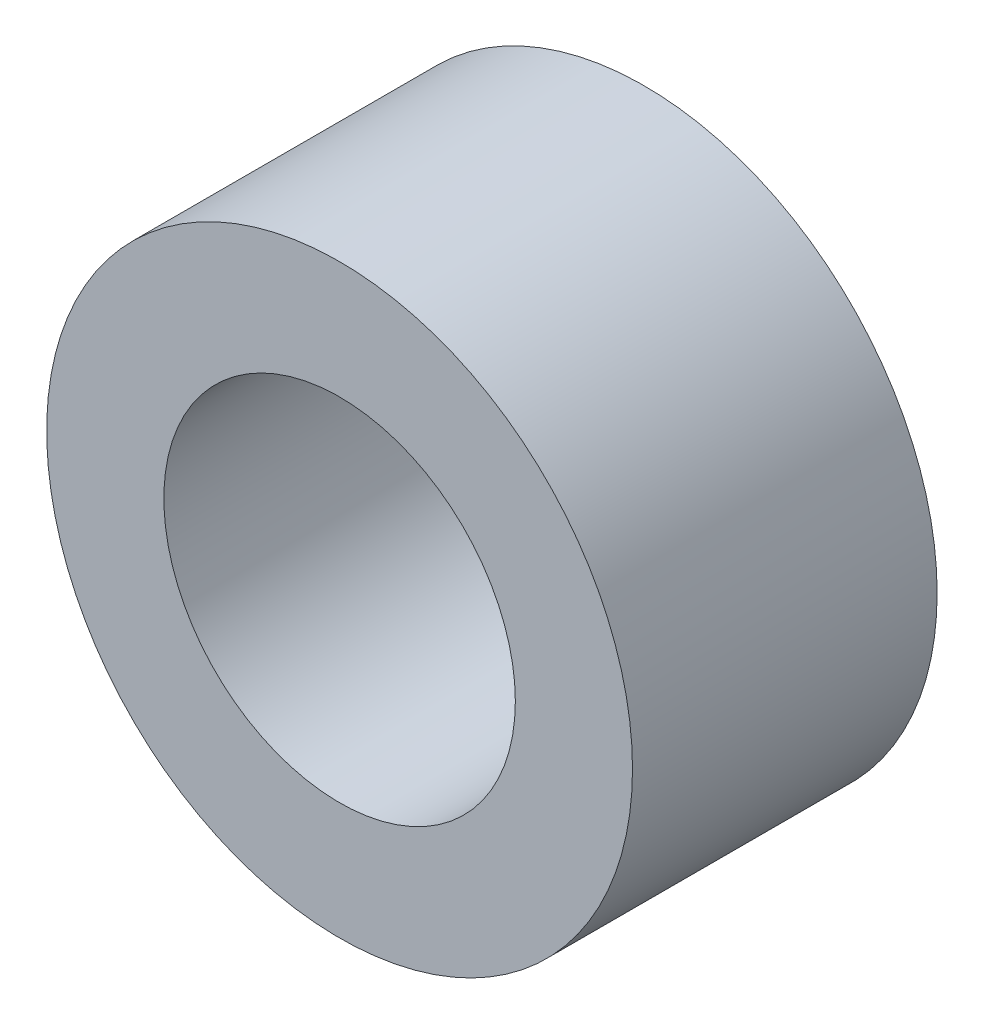
ISO-10303-21;
HEADER;
FILE_DESCRIPTION(('STEP AP214'),'2;1');
FILE_NAME('part.step','',(''),(''),'','','');
FILE_SCHEMA(('AUTOMOTIVE_DESIGN { 1 0 10303 214 1 1 1 1 }'));
ENDSEC;
DATA;
#1=APPLICATION_CONTEXT('core data for automotive mechanical design processes');
#2=APPLICATION_PROTOCOL_DEFINITION('international standard','automotive_design',2000,#1);
#3=PRODUCT_CONTEXT('',#1,'mechanical');
#4=PRODUCT('Part','Part','',(#3));
#5=PRODUCT_RELATED_PRODUCT_CATEGORY('part','',(#4));
#6=PRODUCT_DEFINITION_FORMATION('','',#4);
#7=PRODUCT_DEFINITION_CONTEXT('part definition',#1,'design');
#8=PRODUCT_DEFINITION('design','',#6,#7);
#9=PRODUCT_DEFINITION_SHAPE('','',#8);
#10=(LENGTH_UNIT() NAMED_UNIT(*) SI_UNIT(.MILLI.,.METRE.));
#11=(NAMED_UNIT(*) PLANE_ANGLE_UNIT() SI_UNIT($,.RADIAN.));
#12=(NAMED_UNIT(*) SI_UNIT($,.STERADIAN.) SOLID_ANGLE_UNIT());
#13=UNCERTAINTY_MEASURE_WITH_UNIT(LENGTH_MEASURE(1.E-05),#10,'distance_accuracy_value','');
#14=(GEOMETRIC_REPRESENTATION_CONTEXT(3) GLOBAL_UNCERTAINTY_ASSIGNED_CONTEXT((#13)) GLOBAL_UNIT_ASSIGNED_CONTEXT((#10,
#11,#12)) REPRESENTATION_CONTEXT('',''));
#15=CARTESIAN_POINT('',(0.,0.,0.));
#16=DIRECTION('',(0.,0.,1.));
#17=DIRECTION('',(1.,0.,0.));
#18=AXIS2_PLACEMENT_3D('',#15,#16,#17);
#19=CARTESIAN_POINT('',(0.,0.,2.6));
#20=DIRECTION('',(0.,0.,1.));
#21=DIRECTION('',(1.,0.,0.));
#22=AXIS2_PLACEMENT_3D('',#19,#20,#21);
#23=PLANE('',#22);
#24=CARTESIAN_POINT('',(0.,0.,2.6));
#25=DIRECTION('',(0.,0.,1.));
#26=DIRECTION('',(1.,0.,0.));
#27=AXIS2_PLACEMENT_3D('',#24,#25,#26);
#28=CIRCLE('',#27,2.5);
#29=CARTESIAN_POINT('',(2.5,0.,2.6));
#30=VERTEX_POINT('',#29);
#31=EDGE_CURVE('E10',#30,#30,#28,.T.);
#32=ORIENTED_EDGE('',*,*,#31,.T.);
#33=EDGE_LOOP('',(#32));
#34=FACE_BOUND('',#33,.T.);
#35=CARTESIAN_POINT('',(0.,0.,2.6));
#36=DIRECTION('',(0.,0.,1.));
#37=DIRECTION('',(1.,0.,0.));
#38=AXIS2_PLACEMENT_3D('',#35,#36,#37);
#39=CIRCLE('',#38,1.5);
#40=CARTESIAN_POINT('',(1.5,0.,2.6));
#41=VERTEX_POINT('',#40);
#42=EDGE_CURVE('E45',#41,#41,#39,.T.);
#43=ORIENTED_EDGE('',*,*,#42,.F.);
#44=EDGE_LOOP('',(#43));
#45=FACE_BOUND('',#44,.T.);
#46=ADVANCED_FACE('F34',(#34,#45),#23,.T.);
#47=CARTESIAN_POINT('',(0.,0.,0.));
#48=DIRECTION('',(0.,0.,1.));
#49=DIRECTION('',(1.,0.,0.));
#50=AXIS2_PLACEMENT_3D('',#47,#48,#49);
#51=PLANE('',#50);
#52=CARTESIAN_POINT('',(0.,0.,0.));
#53=DIRECTION('',(0.,0.,1.));
#54=DIRECTION('',(1.,0.,0.));
#55=AXIS2_PLACEMENT_3D('',#52,#53,#54);
#56=CIRCLE('',#55,2.5);
#57=CARTESIAN_POINT('',(2.5,0.,0.));
#58=VERTEX_POINT('',#57);
#59=EDGE_CURVE('E38',#58,#58,#56,.T.);
#60=ORIENTED_EDGE('',*,*,#59,.F.);
#61=EDGE_LOOP('',(#60));
#62=FACE_BOUND('',#61,.T.);
#63=CARTESIAN_POINT('',(0.,0.,0.));
#64=DIRECTION('',(0.,0.,1.));
#65=DIRECTION('',(1.,0.,0.));
#66=AXIS2_PLACEMENT_3D('',#63,#64,#65);
#67=CIRCLE('',#66,1.5);
#68=CARTESIAN_POINT('',(1.5,0.,0.));
#69=VERTEX_POINT('',#68);
#70=EDGE_CURVE('E47',#69,#69,#67,.T.);
#71=ORIENTED_EDGE('',*,*,#70,.T.);
#72=EDGE_LOOP('',(#71));
#73=FACE_BOUND('',#72,.T.);
#74=ADVANCED_FACE('F57',(#62,#73),#51,.F.);
#75=CARTESIAN_POINT('',(0.,0.,2.6));
#76=DIRECTION('',(0.,0.,-1.));
#77=DIRECTION('',(-1.,0.,0.));
#78=AXIS2_PLACEMENT_3D('',#75,#76,#77);
#79=CYLINDRICAL_SURFACE('',#78,2.5);
#80=ORIENTED_EDGE('',*,*,#31,.F.);
#81=EDGE_LOOP('',(#80));
#82=FACE_BOUND('',#81,.T.);
#83=ORIENTED_EDGE('',*,*,#59,.T.);
#84=EDGE_LOOP('',(#83));
#85=FACE_BOUND('',#84,.T.);
#86=ADVANCED_FACE('F36',(#82,#85),#79,.T.);
#87=CARTESIAN_POINT('',(0.,0.,2.6));
#88=DIRECTION('',(0.,0.,-1.));
#89=DIRECTION('',(-1.,0.,0.));
#90=AXIS2_PLACEMENT_3D('',#87,#88,#89);
#91=CYLINDRICAL_SURFACE('',#90,1.5);
#92=ORIENTED_EDGE('',*,*,#42,.T.);
#93=EDGE_LOOP('',(#92));
#94=FACE_BOUND('',#93,.T.);
#95=ORIENTED_EDGE('',*,*,#70,.F.);
#96=EDGE_LOOP('',(#95));
#97=FACE_BOUND('',#96,.T.);
#98=ADVANCED_FACE('F53',(#94,#97),#91,.F.);
#99=CLOSED_SHELL('',(#46,#74,#86,#98));
#100=MANIFOLD_SOLID_BREP('B2',#99);
#101=ADVANCED_BREP_SHAPE_REPRESENTATION('',(#18,#100),#14);
#102=SHAPE_DEFINITION_REPRESENTATION(#9,#101);
ENDSEC;
END-ISO-10303-21;
